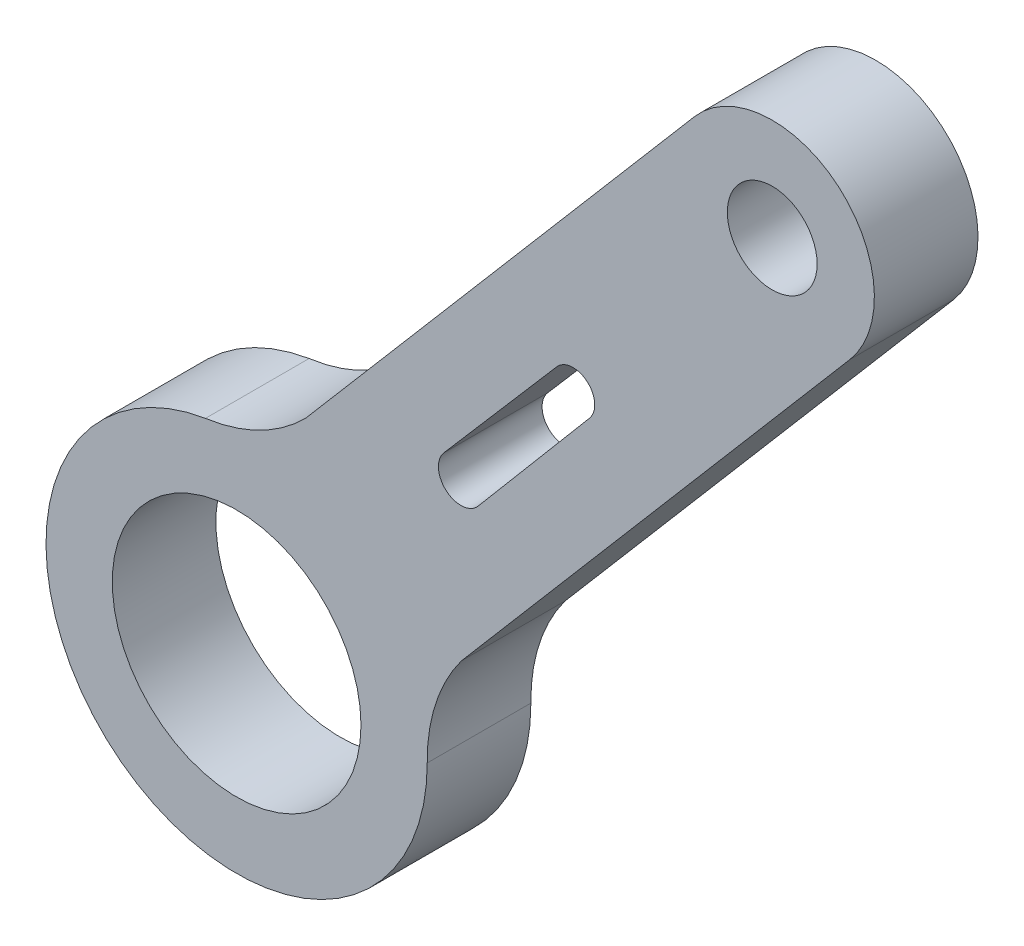
ISO-10303-21;
HEADER;
FILE_DESCRIPTION(('STEP AP214'),'2;1');
FILE_NAME('part.step','',(''),(''),'','','');
FILE_SCHEMA(('AUTOMOTIVE_DESIGN { 1 0 10303 214 1 1 1 1 }'));
ENDSEC;
DATA;
#1=APPLICATION_CONTEXT('core data for automotive mechanical design processes');
#2=APPLICATION_PROTOCOL_DEFINITION('international standard','automotive_design',2000,#1);
#3=PRODUCT_CONTEXT('',#1,'mechanical');
#4=PRODUCT('Part','Part','',(#3));
#5=PRODUCT_RELATED_PRODUCT_CATEGORY('part','',(#4));
#6=PRODUCT_DEFINITION_FORMATION('','',#4);
#7=PRODUCT_DEFINITION_CONTEXT('part definition',#1,'design');
#8=PRODUCT_DEFINITION('design','',#6,#7);
#9=PRODUCT_DEFINITION_SHAPE('','',#8);
#10=(LENGTH_UNIT() NAMED_UNIT(*) SI_UNIT(.MILLI.,.METRE.));
#11=(NAMED_UNIT(*) PLANE_ANGLE_UNIT() SI_UNIT($,.RADIAN.));
#12=(NAMED_UNIT(*) SI_UNIT($,.STERADIAN.) SOLID_ANGLE_UNIT());
#13=UNCERTAINTY_MEASURE_WITH_UNIT(LENGTH_MEASURE(1.E-05),#10,'distance_accuracy_value','');
#14=(GEOMETRIC_REPRESENTATION_CONTEXT(3) GLOBAL_UNCERTAINTY_ASSIGNED_CONTEXT((#13)) GLOBAL_UNIT_ASSIGNED_CONTEXT((#10,
#11,#12)) REPRESENTATION_CONTEXT('',''));
#15=CARTESIAN_POINT('',(0.,0.,0.));
#16=DIRECTION('',(0.,0.,1.));
#17=DIRECTION('',(1.,0.,0.));
#18=AXIS2_PLACEMENT_3D('',#15,#16,#17);
#19=CARTESIAN_POINT('',(40.3258956464171,32.3001005578566,3.));
#20=DIRECTION('',(0.,0.,1.));
#21=DIRECTION('',(1.,0.,0.));
#22=AXIS2_PLACEMENT_3D('',#19,#20,#21);
#23=PLANE('',#22);
#24=CARTESIAN_POINT('',(40.3258956464171,32.3001005578566,3.));
#25=DIRECTION('',(0.,0.,1.));
#26=DIRECTION('',(1.,0.,0.));
#27=AXIS2_PLACEMENT_3D('',#24,#25,#26);
#28=CIRCLE('',#27,3.6);
#29=CARTESIAN_POINT('',(43.9258956464171,32.3001005578566,3.));
#30=VERTEX_POINT('',#29);
#31=EDGE_CURVE('E154',#30,#30,#28,.T.);
#32=ORIENTED_EDGE('',*,*,#31,.F.);
#33=EDGE_LOOP('',(#32));
#34=FACE_BOUND('',#33,.T.);
#35=CARTESIAN_POINT('',(40.3258956464171,32.3001005578566,3.));
#36=DIRECTION('',(0.,0.,1.));
#37=DIRECTION('',(1.,0.,0.));
#38=AXIS2_PLACEMENT_3D('',#35,#36,#37);
#39=CIRCLE('',#38,5.51783743661575);
#40=CARTESIAN_POINT('',(39.4241511367581,37.7437562060601,3.));
#41=VERTEX_POINT('',#40);
#42=CARTESIAN_POINT('',(45.8437131558382,32.3149299086005,3.));
#43=VERTEX_POINT('',#42);
#44=EDGE_CURVE('E160',#41,#43,#39,.T.);
#45=ORIENTED_EDGE('',*,*,#44,.T.);
#46=CARTESIAN_POINT('',(50.8431237759721,32.3834545460311,3.));
#47=DIRECTION('',(0.,0.,-1.));
#48=DIRECTION('',(1.,0.,0.));
#49=AXIS2_PLACEMENT_3D('',#46,#47,#48);
#50=CIRCLE('',#49,4.99988021602936);
#51=CARTESIAN_POINT('',(46.8301056057806,35.3658172570968,3.));
#52=VERTEX_POINT('',#51);
#53=EDGE_CURVE('E163',#43,#52,#50,.T.);
#54=ORIENTED_EDGE('',*,*,#53,.T.);
#55=DIRECTION('',(0.649172540152731,0.760641185521564,0.));
#56=VECTOR('',#55,1.);
#57=CARTESIAN_POINT('',(58.0684400077373,48.5338727031589,3.));
#58=LINE('',#57,#56);
#59=CARTESIAN_POINT('',(58.0787640635704,48.5459694903496,3.));
#60=VERTEX_POINT('',#59);
#61=EDGE_CURVE('E166',#52,#60,#58,.T.);
#62=ORIENTED_EDGE('',*,*,#61,.T.);
#63=CARTESIAN_POINT('',(55.8294028888192,50.4656966039069,3.));
#64=DIRECTION('',(0.,0.,1.));
#65=DIRECTION('',(-1.,0.,0.));
#66=AXIS2_PLACEMENT_3D('',#63,#64,#65);
#67=CIRCLE('',#66,2.95719087733701);
#68=CARTESIAN_POINT('',(53.580041714068,52.3854237174643,3.));
#69=VERTEX_POINT('',#68);
#70=EDGE_CURVE('E168',#60,#69,#67,.T.);
#71=ORIENTED_EDGE('',*,*,#70,.T.);
#72=DIRECTION('',(-0.649172540152731,-0.760641185521564,0.));
#73=VECTOR('',#72,1.);
#74=CARTESIAN_POINT('',(42.3417073121113,39.2173682714022,3.));
#75=LINE('',#74,#73);
#76=CARTESIAN_POINT('',(42.3417073121113,39.2173682714022,3.));
#77=VERTEX_POINT('',#76);
#78=EDGE_CURVE('E170',#69,#77,#75,.T.);
#79=ORIENTED_EDGE('',*,*,#78,.T.);
#80=CARTESIAN_POINT('',(38.7525533296872,42.6984235698958,3.));
#81=DIRECTION('',(0.,0.,-1.));
#82=DIRECTION('',(1.,0.,0.));
#83=AXIS2_PLACEMENT_3D('',#80,#81,#82);
#84=CIRCLE('',#83,4.99997723002027);
#85=EDGE_CURVE('E172',#77,#41,#84,.T.);
#86=ORIENTED_EDGE('',*,*,#85,.T.);
#87=EDGE_LOOP('',(#45,#54,#62,#71,#79,#86));
#88=FACE_BOUND('',#87,.T.);
#89=CARTESIAN_POINT('',(55.8294028888192,50.4656966039069,3.));
#90=DIRECTION('',(0.,0.,1.));
#91=DIRECTION('',(1.,0.,0.));
#92=AXIS2_PLACEMENT_3D('',#89,#90,#91);
#93=CIRCLE('',#92,1.3);
#94=CARTESIAN_POINT('',(57.1294028888192,50.4656966039069,3.));
#95=VERTEX_POINT('',#94);
#96=EDGE_CURVE('E148',#95,#95,#93,.T.);
#97=ORIENTED_EDGE('',*,*,#96,.F.);
#98=EDGE_LOOP('',(#97));
#99=FACE_BOUND('',#98,.T.);
#100=DIRECTION('',(-0.653000783038569,-0.75735723232238,0.));
#101=VECTOR('',#100,1.);
#102=CARTESIAN_POINT('',(49.5898706663628,44.117156913356,3.));
#103=LINE('',#102,#101);
#104=CARTESIAN_POINT('',(49.5898706663628,44.117156913356,3.));
#105=VERTEX_POINT('',#104);
#106=CARTESIAN_POINT('',(46.3214633864109,40.3264234932087,3.));
#107=VERTEX_POINT('',#106);
#108=EDGE_CURVE('E120',#105,#107,#103,.T.);
#109=ORIENTED_EDGE('',*,*,#108,.F.);
#110=CARTESIAN_POINT('',(50.0670017013361,43.713840356773,3.));
#111=DIRECTION('',(0.,0.,1.));
#112=DIRECTION('',(1.,0.,0.));
#113=AXIS2_PLACEMENT_3D('',#110,#111,#112);
#114=CIRCLE('',#113,0.624754567289162);
#115=CARTESIAN_POINT('',(50.544132712497,43.3105237720195,3.));
#116=VERTEX_POINT('',#115);
#117=EDGE_CURVE('E112',#116,#105,#114,.T.);
#118=ORIENTED_EDGE('',*,*,#117,.F.);
#119=DIRECTION('',(0.645327596806926,0.763905944995454,0.));
#120=VECTOR('',#119,1.);
#121=CARTESIAN_POINT('',(47.3142870178119,39.4871969225308,3.));
#122=LINE('',#121,#120);
#123=CARTESIAN_POINT('',(47.3142870178119,39.4871969225308,3.));
#124=VERTEX_POINT('',#123);
#125=EDGE_CURVE('E134',#124,#116,#122,.T.);
#126=ORIENTED_EDGE('',*,*,#125,.F.);
#127=CARTESIAN_POINT('',(46.8178751914583,39.9068101952669,3.));
#128=DIRECTION('',(0.,0.,1.));
#129=DIRECTION('',(1.,0.,0.));
#130=AXIS2_PLACEMENT_3D('',#127,#128,#129);
#131=CIRCLE('',#130,0.65);
#132=EDGE_CURVE('E132',#107,#124,#131,.T.);
#133=ORIENTED_EDGE('',*,*,#132,.F.);
#134=EDGE_LOOP('',(#109,#118,#126,#133));
#135=FACE_BOUND('',#134,.T.);
#136=ADVANCED_FACE('F35',(#34,#88,#99,#135),#23,.T.);
#137=CARTESIAN_POINT('',(40.3258956464171,32.3001005578566,0.));
#138=DIRECTION('',(0.,0.,1.));
#139=DIRECTION('',(1.,0.,0.));
#140=AXIS2_PLACEMENT_3D('',#137,#138,#139);
#141=PLANE('',#140);
#142=CARTESIAN_POINT('',(55.8294028888192,50.4656966039069,0.));
#143=DIRECTION('',(0.,0.,1.));
#144=DIRECTION('',(1.,0.,0.));
#145=AXIS2_PLACEMENT_3D('',#142,#143,#144);
#146=CIRCLE('',#145,1.3);
#147=CARTESIAN_POINT('',(57.1294028888192,50.4656966039069,0.));
#148=VERTEX_POINT('',#147);
#149=EDGE_CURVE('E128',#148,#148,#146,.T.);
#150=ORIENTED_EDGE('',*,*,#149,.T.);
#151=EDGE_LOOP('',(#150));
#152=FACE_BOUND('',#151,.T.);
#153=CARTESIAN_POINT('',(40.3258956464171,32.3001005578566,0.));
#154=DIRECTION('',(0.,0.,1.));
#155=DIRECTION('',(1.,0.,0.));
#156=AXIS2_PLACEMENT_3D('',#153,#154,#155);
#157=CIRCLE('',#156,3.6);
#158=CARTESIAN_POINT('',(43.9258956464171,32.3001005578566,0.));
#159=VERTEX_POINT('',#158);
#160=EDGE_CURVE('E151',#159,#159,#157,.T.);
#161=ORIENTED_EDGE('',*,*,#160,.T.);
#162=EDGE_LOOP('',(#161));
#163=FACE_BOUND('',#162,.T.);
#164=CARTESIAN_POINT('',(40.3258956464171,32.3001005578566,0.));
#165=DIRECTION('',(0.,0.,1.));
#166=DIRECTION('',(1.,0.,0.));
#167=AXIS2_PLACEMENT_3D('',#164,#165,#166);
#168=CIRCLE('',#167,5.51783743661575);
#169=CARTESIAN_POINT('',(39.4241511367581,37.7437562060601,0.));
#170=VERTEX_POINT('',#169);
#171=CARTESIAN_POINT('',(45.8437131558382,32.3149299086005,0.));
#172=VERTEX_POINT('',#171);
#173=EDGE_CURVE('E157',#170,#172,#168,.T.);
#174=ORIENTED_EDGE('',*,*,#173,.F.);
#175=CARTESIAN_POINT('',(38.7525533296872,42.6984235698958,0.));
#176=DIRECTION('',(0.,0.,-1.));
#177=DIRECTION('',(1.,0.,0.));
#178=AXIS2_PLACEMENT_3D('',#175,#176,#177);
#179=CIRCLE('',#178,4.99997723002027);
#180=CARTESIAN_POINT('',(42.3417073121113,39.2173682714022,0.));
#181=VERTEX_POINT('',#180);
#182=EDGE_CURVE('E164',#181,#170,#179,.T.);
#183=ORIENTED_EDGE('',*,*,#182,.F.);
#184=DIRECTION('',(-0.649172540152731,-0.760641185521564,0.));
#185=VECTOR('',#184,1.);
#186=CARTESIAN_POINT('',(42.3417073121113,39.2173682714022,0.));
#187=LINE('',#186,#185);
#188=CARTESIAN_POINT('',(53.580041714068,52.3854237174643,0.));
#189=VERTEX_POINT('',#188);
#190=EDGE_CURVE('E184',#189,#181,#187,.T.);
#191=ORIENTED_EDGE('',*,*,#190,.F.);
#192=CARTESIAN_POINT('',(55.8294028888192,50.4656966039069,0.));
#193=DIRECTION('',(0.,0.,1.));
#194=DIRECTION('',(-1.,0.,0.));
#195=AXIS2_PLACEMENT_3D('',#192,#193,#194);
#196=CIRCLE('',#195,2.95719087733701);
#197=CARTESIAN_POINT('',(58.0787640635704,48.5459694903496,0.));
#198=VERTEX_POINT('',#197);
#199=EDGE_CURVE('E182',#198,#189,#196,.T.);
#200=ORIENTED_EDGE('',*,*,#199,.F.);
#201=DIRECTION('',(0.649172540152422,0.760641185521828,0.));
#202=VECTOR('',#201,1.);
#203=CARTESIAN_POINT('',(58.0684400077373,48.5338727031589,0.));
#204=LINE('',#203,#202);
#205=CARTESIAN_POINT('',(46.8301056057806,35.3658172570968,0.));
#206=VERTEX_POINT('',#205);
#207=EDGE_CURVE('E180',#206,#198,#204,.T.);
#208=ORIENTED_EDGE('',*,*,#207,.F.);
#209=CARTESIAN_POINT('',(50.8431237759721,32.3834545460311,0.));
#210=DIRECTION('',(0.,0.,-1.));
#211=DIRECTION('',(1.,0.,0.));
#212=AXIS2_PLACEMENT_3D('',#209,#210,#211);
#213=CIRCLE('',#212,4.99988021602936);
#214=EDGE_CURVE('E177',#172,#206,#213,.T.);
#215=ORIENTED_EDGE('',*,*,#214,.F.);
#216=EDGE_LOOP('',(#174,#183,#191,#200,#208,#215));
#217=FACE_BOUND('',#216,.T.);
#218=CARTESIAN_POINT('',(50.0670017013361,43.713840356773,0.));
#219=DIRECTION('',(0.,0.,1.));
#220=DIRECTION('',(1.,0.,0.));
#221=AXIS2_PLACEMENT_3D('',#218,#219,#220);
#222=CIRCLE('',#221,0.624754567289162);
#223=CARTESIAN_POINT('',(50.544132712497,43.3105237720195,0.));
#224=VERTEX_POINT('',#223);
#225=CARTESIAN_POINT('',(49.5898706663628,44.117156913356,0.));
#226=VERTEX_POINT('',#225);
#227=EDGE_CURVE('E58',#224,#226,#222,.T.);
#228=ORIENTED_EDGE('',*,*,#227,.T.);
#229=DIRECTION('',(-0.653000783038569,-0.75735723232238,0.));
#230=VECTOR('',#229,1.);
#231=CARTESIAN_POINT('',(49.5898706663628,44.117156913356,0.));
#232=LINE('',#231,#230);
#233=CARTESIAN_POINT('',(46.3214633864109,40.3264234932087,0.));
#234=VERTEX_POINT('',#233);
#235=EDGE_CURVE('E127',#226,#234,#232,.T.);
#236=ORIENTED_EDGE('',*,*,#235,.T.);
#237=CARTESIAN_POINT('',(46.8178751914583,39.9068101952669,0.));
#238=DIRECTION('',(0.,0.,1.));
#239=DIRECTION('',(1.,0.,0.));
#240=AXIS2_PLACEMENT_3D('',#237,#238,#239);
#241=CIRCLE('',#240,0.65);
#242=CARTESIAN_POINT('',(47.3142870178119,39.4871969225308,0.));
#243=VERTEX_POINT('',#242);
#244=EDGE_CURVE('E140',#234,#243,#241,.T.);
#245=ORIENTED_EDGE('',*,*,#244,.T.);
#246=DIRECTION('',(0.645327596806926,0.763905944995454,0.));
#247=VECTOR('',#246,1.);
#248=CARTESIAN_POINT('',(47.3142870178119,39.4871969225308,0.));
#249=LINE('',#248,#247);
#250=EDGE_CURVE('E121',#243,#224,#249,.T.);
#251=ORIENTED_EDGE('',*,*,#250,.T.);
#252=EDGE_LOOP('',(#228,#236,#245,#251));
#253=FACE_BOUND('',#252,.T.);
#254=ADVANCED_FACE('F208',(#152,#163,#217,#253),#141,.F.);
#255=CARTESIAN_POINT('',(40.3258956464171,32.3001005578566,3.));
#256=DIRECTION('',(0.,0.,-1.));
#257=DIRECTION('',(-1.,0.,0.));
#258=AXIS2_PLACEMENT_3D('',#255,#256,#257);
#259=CYLINDRICAL_SURFACE('',#258,5.51783743661575);
#260=ORIENTED_EDGE('',*,*,#173,.T.);
#261=DIRECTION('',(0.,0.,-1.));
#262=VECTOR('',#261,1.);
#263=CARTESIAN_POINT('',(45.8437131558382,32.3149299086005,3.));
#264=LINE('',#263,#262);
#265=EDGE_CURVE('E11',#43,#172,#264,.T.);
#266=ORIENTED_EDGE('',*,*,#265,.F.);
#267=ORIENTED_EDGE('',*,*,#44,.F.);
#268=DIRECTION('',(0.,0.,-1.));
#269=VECTOR('',#268,1.);
#270=CARTESIAN_POINT('',(39.4241511367581,37.7437562060601,3.));
#271=LINE('',#270,#269);
#272=EDGE_CURVE('E174',#41,#170,#271,.T.);
#273=ORIENTED_EDGE('',*,*,#272,.T.);
#274=EDGE_LOOP('',(#260,#266,#267,#273));
#275=FACE_BOUND('',#274,.T.);
#276=ADVANCED_FACE('F37',(#275),#259,.T.);
#277=CARTESIAN_POINT('',(50.8431237759721,32.3834545460311,3.));
#278=DIRECTION('',(0.,0.,-1.));
#279=DIRECTION('',(-1.,0.,0.));
#280=AXIS2_PLACEMENT_3D('',#277,#278,#279);
#281=CYLINDRICAL_SURFACE('',#280,4.99988021602936);
#282=ORIENTED_EDGE('',*,*,#214,.T.);
#283=DIRECTION('',(0.,0.,-1.));
#284=VECTOR('',#283,1.);
#285=CARTESIAN_POINT('',(46.8301056057806,35.3658172570968,3.));
#286=LINE('',#285,#284);
#287=EDGE_CURVE('E43',#52,#206,#286,.T.);
#288=ORIENTED_EDGE('',*,*,#287,.F.);
#289=ORIENTED_EDGE('',*,*,#53,.F.);
#290=ORIENTED_EDGE('',*,*,#265,.T.);
#291=EDGE_LOOP('',(#282,#288,#289,#290));
#292=FACE_BOUND('',#291,.T.);
#293=ADVANCED_FACE('F204',(#292),#281,.F.);
#294=CARTESIAN_POINT('',(58.0684400077373,48.5338727031589,3.));
#295=DIRECTION('',(-0.760641185521828,0.649172540152422,0.));
#296=DIRECTION('',(-0.649172540152422,-0.760641185521828,0.));
#297=AXIS2_PLACEMENT_3D('',#294,#295,#296);
#298=PLANE('',#297);
#299=ORIENTED_EDGE('',*,*,#207,.T.);
#300=DIRECTION('',(0.,0.,-1.));
#301=VECTOR('',#300,1.);
#302=CARTESIAN_POINT('',(58.0787640635704,48.5459694903496,3.));
#303=LINE('',#302,#301);
#304=EDGE_CURVE('E195',#60,#198,#303,.T.);
#305=ORIENTED_EDGE('',*,*,#304,.F.);
#306=ORIENTED_EDGE('',*,*,#61,.F.);
#307=ORIENTED_EDGE('',*,*,#287,.T.);
#308=EDGE_LOOP('',(#299,#305,#306,#307));
#309=FACE_BOUND('',#308,.T.);
#310=ADVANCED_FACE('F201',(#309),#298,.F.);
#311=CARTESIAN_POINT('',(55.8294028888192,50.4656966039069,3.));
#312=DIRECTION('',(0.,0.,-1.));
#313=DIRECTION('',(-1.,0.,0.));
#314=AXIS2_PLACEMENT_3D('',#311,#312,#313);
#315=CYLINDRICAL_SURFACE('',#314,2.95719087733701);
#316=ORIENTED_EDGE('',*,*,#199,.T.);
#317=DIRECTION('',(0.,0.,-1.));
#318=VECTOR('',#317,1.);
#319=CARTESIAN_POINT('',(53.580041714068,52.3854237174643,3.));
#320=LINE('',#319,#318);
#321=EDGE_CURVE('E192',#69,#189,#320,.T.);
#322=ORIENTED_EDGE('',*,*,#321,.F.);
#323=ORIENTED_EDGE('',*,*,#70,.F.);
#324=ORIENTED_EDGE('',*,*,#304,.T.);
#325=EDGE_LOOP('',(#316,#322,#323,#324));
#326=FACE_BOUND('',#325,.T.);
#327=ADVANCED_FACE('F215',(#326),#315,.T.);
#328=CARTESIAN_POINT('',(42.3417073121113,39.2173682714022,3.));
#329=DIRECTION('',(0.760641185521564,-0.649172540152731,0.));
#330=DIRECTION('',(0.649172540152731,0.760641185521564,0.));
#331=AXIS2_PLACEMENT_3D('',#328,#329,#330);
#332=PLANE('',#331);
#333=ORIENTED_EDGE('',*,*,#190,.T.);
#334=DIRECTION('',(0.,0.,-1.));
#335=VECTOR('',#334,1.);
#336=CARTESIAN_POINT('',(42.3417073121113,39.2173682714022,3.));
#337=LINE('',#336,#335);
#338=EDGE_CURVE('E189',#77,#181,#337,.T.);
#339=ORIENTED_EDGE('',*,*,#338,.F.);
#340=ORIENTED_EDGE('',*,*,#78,.F.);
#341=ORIENTED_EDGE('',*,*,#321,.T.);
#342=EDGE_LOOP('',(#333,#339,#340,#341));
#343=FACE_BOUND('',#342,.T.);
#344=ADVANCED_FACE('F219',(#343),#332,.F.);
#345=CARTESIAN_POINT('',(38.7525533296872,42.6984235698958,3.));
#346=DIRECTION('',(0.,0.,-1.));
#347=DIRECTION('',(-1.,0.,0.));
#348=AXIS2_PLACEMENT_3D('',#345,#346,#347);
#349=CYLINDRICAL_SURFACE('',#348,4.99997723002027);
#350=ORIENTED_EDGE('',*,*,#182,.T.);
#351=ORIENTED_EDGE('',*,*,#272,.F.);
#352=ORIENTED_EDGE('',*,*,#85,.F.);
#353=ORIENTED_EDGE('',*,*,#338,.T.);
#354=EDGE_LOOP('',(#350,#351,#352,#353));
#355=FACE_BOUND('',#354,.T.);
#356=ADVANCED_FACE('F228',(#355),#349,.F.);
#357=CARTESIAN_POINT('',(40.3258956464171,32.3001005578566,3.));
#358=DIRECTION('',(0.,0.,-1.));
#359=DIRECTION('',(-1.,0.,0.));
#360=AXIS2_PLACEMENT_3D('',#357,#358,#359);
#361=CYLINDRICAL_SURFACE('',#360,3.6);
#362=ORIENTED_EDGE('',*,*,#31,.T.);
#363=EDGE_LOOP('',(#362));
#364=FACE_BOUND('',#363,.T.);
#365=ORIENTED_EDGE('',*,*,#160,.F.);
#366=EDGE_LOOP('',(#365));
#367=FACE_BOUND('',#366,.T.);
#368=ADVANCED_FACE('F230',(#364,#367),#361,.F.);
#369=CARTESIAN_POINT('',(55.8294028888192,50.4656966039069,3.));
#370=DIRECTION('',(0.,0.,-1.));
#371=DIRECTION('',(-1.,0.,0.));
#372=AXIS2_PLACEMENT_3D('',#369,#370,#371);
#373=CYLINDRICAL_SURFACE('',#372,1.3);
#374=ORIENTED_EDGE('',*,*,#96,.T.);
#375=EDGE_LOOP('',(#374));
#376=FACE_BOUND('',#375,.T.);
#377=ORIENTED_EDGE('',*,*,#149,.F.);
#378=EDGE_LOOP('',(#377));
#379=FACE_BOUND('',#378,.T.);
#380=ADVANCED_FACE('F236',(#376,#379),#373,.F.);
#381=CARTESIAN_POINT('',(50.0670017013361,43.713840356773,3.));
#382=DIRECTION('',(0.,0.,-1.));
#383=DIRECTION('',(-1.,0.,0.));
#384=AXIS2_PLACEMENT_3D('',#381,#382,#383);
#385=CYLINDRICAL_SURFACE('',#384,0.624754567289162);
#386=ORIENTED_EDGE('',*,*,#227,.F.);
#387=DIRECTION('',(0.,0.,-1.));
#388=VECTOR('',#387,1.);
#389=CARTESIAN_POINT('',(50.544132712497,43.3105237720195,3.));
#390=LINE('',#389,#388);
#391=EDGE_CURVE('E116',#116,#224,#390,.T.);
#392=ORIENTED_EDGE('',*,*,#391,.F.);
#393=ORIENTED_EDGE('',*,*,#117,.T.);
#394=DIRECTION('',(0.,0.,-1.));
#395=VECTOR('',#394,1.);
#396=CARTESIAN_POINT('',(49.5898706663628,44.117156913356,3.));
#397=LINE('',#396,#395);
#398=EDGE_CURVE('E115',#105,#226,#397,.T.);
#399=ORIENTED_EDGE('',*,*,#398,.T.);
#400=EDGE_LOOP('',(#386,#392,#393,#399));
#401=FACE_BOUND('',#400,.T.);
#402=ADVANCED_FACE('F114',(#401),#385,.F.);
#403=CARTESIAN_POINT('',(49.5898706663628,44.117156913356,3.));
#404=DIRECTION('',(0.75735723232238,-0.653000783038569,0.));
#405=DIRECTION('',(0.653000783038569,0.75735723232238,0.));
#406=AXIS2_PLACEMENT_3D('',#403,#404,#405);
#407=PLANE('',#406);
#408=ORIENTED_EDGE('',*,*,#235,.F.);
#409=ORIENTED_EDGE('',*,*,#398,.F.);
#410=ORIENTED_EDGE('',*,*,#108,.T.);
#411=DIRECTION('',(0.,0.,-1.));
#412=VECTOR('',#411,1.);
#413=CARTESIAN_POINT('',(46.3214633864109,40.3264234932087,3.));
#414=LINE('',#413,#412);
#415=EDGE_CURVE('E129',#107,#234,#414,.T.);
#416=ORIENTED_EDGE('',*,*,#415,.T.);
#417=EDGE_LOOP('',(#408,#409,#410,#416));
#418=FACE_BOUND('',#417,.T.);
#419=ADVANCED_FACE('F124',(#418),#407,.T.);
#420=CARTESIAN_POINT('',(46.8178751914583,39.9068101952669,3.));
#421=DIRECTION('',(0.,0.,-1.));
#422=DIRECTION('',(-1.,0.,0.));
#423=AXIS2_PLACEMENT_3D('',#420,#421,#422);
#424=CYLINDRICAL_SURFACE('',#423,0.65);
#425=ORIENTED_EDGE('',*,*,#244,.F.);
#426=ORIENTED_EDGE('',*,*,#415,.F.);
#427=ORIENTED_EDGE('',*,*,#132,.T.);
#428=DIRECTION('',(0.,0.,-1.));
#429=VECTOR('',#428,1.);
#430=CARTESIAN_POINT('',(47.3142870178119,39.4871969225308,3.));
#431=LINE('',#430,#429);
#432=EDGE_CURVE('E50',#124,#243,#431,.T.);
#433=ORIENTED_EDGE('',*,*,#432,.T.);
#434=EDGE_LOOP('',(#425,#426,#427,#433));
#435=FACE_BOUND('',#434,.T.);
#436=ADVANCED_FACE('F257',(#435),#424,.F.);
#437=CARTESIAN_POINT('',(47.3142870178119,39.4871969225308,3.));
#438=DIRECTION('',(-0.763905944995454,0.645327596806926,0.));
#439=DIRECTION('',(-0.645327596806926,-0.763905944995455,0.));
#440=AXIS2_PLACEMENT_3D('',#437,#438,#439);
#441=PLANE('',#440);
#442=ORIENTED_EDGE('',*,*,#250,.F.);
#443=ORIENTED_EDGE('',*,*,#432,.F.);
#444=ORIENTED_EDGE('',*,*,#125,.T.);
#445=ORIENTED_EDGE('',*,*,#391,.T.);
#446=EDGE_LOOP('',(#442,#443,#444,#445));
#447=FACE_BOUND('',#446,.T.);
#448=ADVANCED_FACE('F260',(#447),#441,.T.);
#449=CLOSED_SHELL('',(#136,#254,#276,#293,#310,#327,#344,#356,#368,#380,#402,#419,#436,#448));
#450=MANIFOLD_SOLID_BREP('B2',#449);
#451=ADVANCED_BREP_SHAPE_REPRESENTATION('',(#18,#450),#14);
#452=SHAPE_DEFINITION_REPRESENTATION(#9,#451);
ENDSEC;
END-ISO-10303-21;
